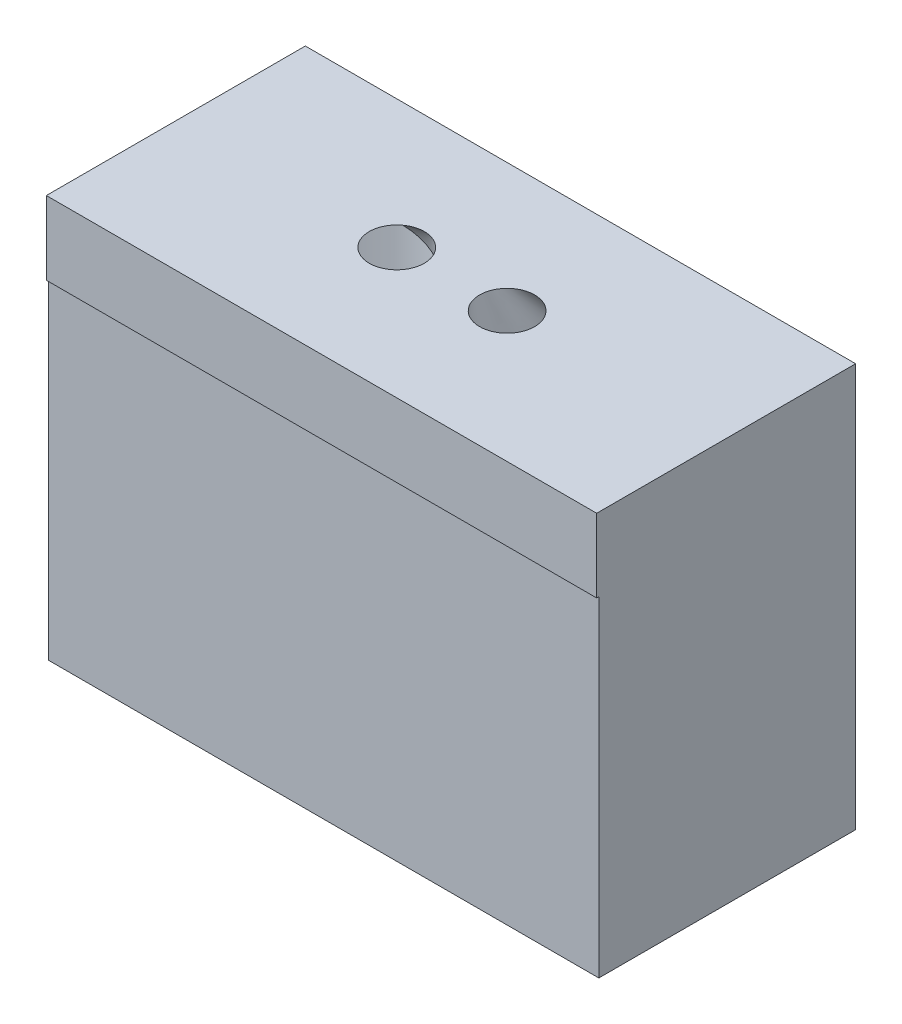
ISO-10303-21;
HEADER;
FILE_DESCRIPTION(('STEP AP214'),'2;1');
FILE_NAME('part.step','',(''),(''),'','','');
FILE_SCHEMA(('AUTOMOTIVE_DESIGN { 1 0 10303 214 1 1 1 1 }'));
ENDSEC;
DATA;
#1=APPLICATION_CONTEXT('core data for automotive mechanical design processes');
#2=APPLICATION_PROTOCOL_DEFINITION('international standard','automotive_design',2000,#1);
#3=PRODUCT_CONTEXT('',#1,'mechanical');
#4=PRODUCT('Part','Part','',(#3));
#5=PRODUCT_RELATED_PRODUCT_CATEGORY('part','',(#4));
#6=PRODUCT_DEFINITION_FORMATION('','',#4);
#7=PRODUCT_DEFINITION_CONTEXT('part definition',#1,'design');
#8=PRODUCT_DEFINITION('design','',#6,#7);
#9=PRODUCT_DEFINITION_SHAPE('','',#8);
#10=(LENGTH_UNIT() NAMED_UNIT(*) SI_UNIT(.MILLI.,.METRE.));
#11=(NAMED_UNIT(*) PLANE_ANGLE_UNIT() SI_UNIT($,.RADIAN.));
#12=(NAMED_UNIT(*) SI_UNIT($,.STERADIAN.) SOLID_ANGLE_UNIT());
#13=UNCERTAINTY_MEASURE_WITH_UNIT(LENGTH_MEASURE(1.E-05),#10,'distance_accuracy_value','');
#14=(GEOMETRIC_REPRESENTATION_CONTEXT(3) GLOBAL_UNCERTAINTY_ASSIGNED_CONTEXT((#13)) GLOBAL_UNIT_ASSIGNED_CONTEXT((#10,
#11,#12)) REPRESENTATION_CONTEXT('',''));
#15=CARTESIAN_POINT('',(0.,0.,0.));
#16=DIRECTION('',(0.,0.,1.));
#17=DIRECTION('',(1.,0.,0.));
#18=AXIS2_PLACEMENT_3D('',#15,#16,#17);
#19=CARTESIAN_POINT('',(-8.,9.,0.));
#20=DIRECTION('',(0.,-1.,0.));
#21=DIRECTION('',(0.,0.,-1.));
#22=AXIS2_PLACEMENT_3D('',#19,#20,#21);
#23=CYLINDRICAL_SURFACE('',#22,2.6);
#24=CARTESIAN_POINT('',(-8.,9.,0.));
#25=DIRECTION('',(0.,1.,0.));
#26=DIRECTION('',(0.,0.,1.));
#27=AXIS2_PLACEMENT_3D('',#24,#25,#26);
#28=CIRCLE('',#27,2.6);
#29=CARTESIAN_POINT('',(-5.4014964042924,9.,-0.0881989971295183));
#30=VERTEX_POINT('',#29);
#31=EDGE_CURVE('E176',#30,#30,#28,.T.);
#32=ORIENTED_EDGE('',*,*,#31,.T.);
#33=EDGE_LOOP('',(#32));
#34=FACE_BOUND('',#33,.T.);
#35=CARTESIAN_POINT('',(-8.,0.999999999999999,0.));
#36=DIRECTION('',(0.,-1.,0.));
#37=DIRECTION('',(0.,0.,-1.));
#38=AXIS2_PLACEMENT_3D('',#35,#36,#37);
#39=CIRCLE('',#38,2.6);
#40=CARTESIAN_POINT('',(-8.,0.999999999999999,-2.6));
#41=VERTEX_POINT('',#40);
#42=EDGE_CURVE('E166',#41,#41,#39,.T.);
#43=ORIENTED_EDGE('',*,*,#42,.T.);
#44=EDGE_LOOP('',(#43));
#45=FACE_BOUND('',#44,.T.);
#46=ADVANCED_FACE('F93',(#34,#45),#23,.F.);
#47=CARTESIAN_POINT('',(0.,9.,0.));
#48=DIRECTION('',(0.,-1.,0.));
#49=DIRECTION('',(0.,0.,-1.));
#50=AXIS2_PLACEMENT_3D('',#47,#48,#49);
#51=CYLINDRICAL_SURFACE('',#50,2.6);
#52=CARTESIAN_POINT('',(0.,9.,0.));
#53=DIRECTION('',(0.,1.,0.));
#54=DIRECTION('',(0.,0.,1.));
#55=AXIS2_PLACEMENT_3D('',#52,#53,#54);
#56=CIRCLE('',#55,2.6);
#57=CARTESIAN_POINT('',(2.15772817787684,9.,1.45058922869168));
#58=VERTEX_POINT('',#57);
#59=EDGE_CURVE('E280',#58,#58,#56,.T.);
#60=ORIENTED_EDGE('',*,*,#59,.T.);
#61=EDGE_LOOP('',(#60));
#62=FACE_BOUND('',#61,.T.);
#63=CARTESIAN_POINT('',(0.,0.999999999999999,0.));
#64=DIRECTION('',(0.,-1.,0.));
#65=DIRECTION('',(0.,0.,-1.));
#66=AXIS2_PLACEMENT_3D('',#63,#64,#65);
#67=CIRCLE('',#66,2.6);
#68=CARTESIAN_POINT('',(0.,0.999999999999999,-2.6));
#69=VERTEX_POINT('',#68);
#70=EDGE_CURVE('E162',#69,#69,#67,.T.);
#71=ORIENTED_EDGE('',*,*,#70,.T.);
#72=EDGE_LOOP('',(#71));
#73=FACE_BOUND('',#72,.T.);
#74=ADVANCED_FACE('F192',(#62,#73),#51,.F.);
#75=CARTESIAN_POINT('',(0.,0.,0.));
#76=DIRECTION('',(0.,1.,0.));
#77=DIRECTION('',(0.,0.,1.));
#78=AXIS2_PLACEMENT_3D('',#75,#76,#77);
#79=PLANE('',#78);
#80=CARTESIAN_POINT('',(0.,0.,0.));
#81=DIRECTION('',(0.,-1.,0.));
#82=DIRECTION('',(0.,0.,-1.));
#83=AXIS2_PLACEMENT_3D('',#80,#81,#82);
#84=CIRCLE('',#83,3.);
#85=CARTESIAN_POINT('',(0.,0.,-3.));
#86=VERTEX_POINT('',#85);
#87=EDGE_CURVE('E231',#86,#86,#84,.T.);
#88=ORIENTED_EDGE('',*,*,#87,.F.);
#89=EDGE_LOOP('',(#88));
#90=FACE_BOUND('',#89,.T.);
#91=CARTESIAN_POINT('',(-8.,0.,0.));
#92=DIRECTION('',(0.,-1.,0.));
#93=DIRECTION('',(0.,0.,-1.));
#94=AXIS2_PLACEMENT_3D('',#91,#92,#93);
#95=CIRCLE('',#94,3.);
#96=CARTESIAN_POINT('',(-8.,0.,-3.));
#97=VERTEX_POINT('',#96);
#98=EDGE_CURVE('E222',#97,#97,#95,.T.);
#99=ORIENTED_EDGE('',*,*,#98,.F.);
#100=EDGE_LOOP('',(#99));
#101=FACE_BOUND('',#100,.T.);
#102=DIRECTION('',(1.,0.,0.));
#103=VECTOR('',#102,1.);
#104=CARTESIAN_POINT('',(-11.5,0.,-3.5));
#105=LINE('',#104,#103);
#106=CARTESIAN_POINT('',(-11.5,0.,-3.5));
#107=VERTEX_POINT('',#106);
#108=CARTESIAN_POINT('',(3.5,0.,-3.5));
#109=VERTEX_POINT('',#108);
#110=EDGE_CURVE('E171',#107,#109,#105,.T.);
#111=ORIENTED_EDGE('',*,*,#110,.T.);
#112=DIRECTION('',(0.,0.,-1.));
#113=VECTOR('',#112,1.);
#114=CARTESIAN_POINT('',(3.5,0.,3.5));
#115=LINE('',#114,#113);
#116=CARTESIAN_POINT('',(3.5,0.,3.5));
#117=VERTEX_POINT('',#116);
#118=EDGE_CURVE('E144',#117,#109,#115,.T.);
#119=ORIENTED_EDGE('',*,*,#118,.F.);
#120=DIRECTION('',(1.,0.,0.));
#121=VECTOR('',#120,1.);
#122=CARTESIAN_POINT('',(-11.5,0.,3.5));
#123=LINE('',#122,#121);
#124=CARTESIAN_POINT('',(-11.5,0.,3.5));
#125=VERTEX_POINT('',#124);
#126=EDGE_CURVE('E129',#125,#117,#123,.T.);
#127=ORIENTED_EDGE('',*,*,#126,.F.);
#128=DIRECTION('',(0.,0.,-1.));
#129=VECTOR('',#128,1.);
#130=CARTESIAN_POINT('',(-11.5,0.,3.5));
#131=LINE('',#130,#129);
#132=EDGE_CURVE('E142',#125,#107,#131,.T.);
#133=ORIENTED_EDGE('',*,*,#132,.T.);
#134=EDGE_LOOP('',(#111,#119,#127,#133));
#135=FACE_BOUND('',#134,.T.);
#136=ADVANCED_FACE('F141',(#90,#101,#135),#79,.F.);
#137=CARTESIAN_POINT('',(-11.5,9.,-3.5));
#138=DIRECTION('',(0.,0.,-1.));
#139=DIRECTION('',(-1.,0.,0.));
#140=AXIS2_PLACEMENT_3D('',#137,#138,#139);
#141=PLANE('',#140);
#142=ORIENTED_EDGE('',*,*,#110,.F.);
#143=DIRECTION('',(0.,-1.,0.));
#144=VECTOR('',#143,1.);
#145=CARTESIAN_POINT('',(-11.5,9.,-3.5));
#146=LINE('',#145,#144);
#147=CARTESIAN_POINT('',(-11.5,11.,-3.5));
#148=VERTEX_POINT('',#147);
#149=EDGE_CURVE('E12',#148,#107,#146,.T.);
#150=ORIENTED_EDGE('',*,*,#149,.F.);
#151=DIRECTION('',(-1.,0.,0.));
#152=VECTOR('',#151,1.);
#153=CARTESIAN_POINT('',(-11.5,11.,-3.5));
#154=LINE('',#153,#152);
#155=CARTESIAN_POINT('',(3.5,11.,-3.5));
#156=VERTEX_POINT('',#155);
#157=EDGE_CURVE('E245',#156,#148,#154,.T.);
#158=ORIENTED_EDGE('',*,*,#157,.F.);
#159=DIRECTION('',(0.,-1.,0.));
#160=VECTOR('',#159,1.);
#161=CARTESIAN_POINT('',(3.5,9.,-3.5));
#162=LINE('',#161,#160);
#163=EDGE_CURVE('E154',#156,#109,#162,.T.);
#164=ORIENTED_EDGE('',*,*,#163,.T.);
#165=EDGE_LOOP('',(#142,#150,#158,#164));
#166=FACE_BOUND('',#165,.T.);
#167=ADVANCED_FACE('F95',(#166),#141,.T.);
#168=CARTESIAN_POINT('',(-11.5,9.,3.5));
#169=DIRECTION('',(-1.,0.,0.));
#170=DIRECTION('',(0.,0.,1.));
#171=AXIS2_PLACEMENT_3D('',#168,#169,#170);
#172=PLANE('',#171);
#173=ORIENTED_EDGE('',*,*,#132,.F.);
#174=DIRECTION('',(0.,-1.,0.));
#175=VECTOR('',#174,1.);
#176=CARTESIAN_POINT('',(-11.5,9.,3.5));
#177=LINE('',#176,#175);
#178=CARTESIAN_POINT('',(-11.5,9.,3.5));
#179=VERTEX_POINT('',#178);
#180=EDGE_CURVE('E106',#179,#125,#177,.T.);
#181=ORIENTED_EDGE('',*,*,#180,.F.);
#182=DIRECTION('',(0.,0.,1.));
#183=VECTOR('',#182,1.);
#184=CARTESIAN_POINT('',(-11.5,9.,-3.5));
#185=LINE('',#184,#183);
#186=CARTESIAN_POINT('',(-11.5,9.,3.55873911571481));
#187=VERTEX_POINT('',#186);
#188=EDGE_CURVE('E254',#179,#187,#185,.T.);
#189=ORIENTED_EDGE('',*,*,#188,.T.);
#190=DIRECTION('',(0.,-1.,0.));
#191=VECTOR('',#190,1.);
#192=CARTESIAN_POINT('',(-11.5,11.,3.55873911571481));
#193=LINE('',#192,#191);
#194=CARTESIAN_POINT('',(-11.5,11.,3.55873911571481));
#195=VERTEX_POINT('',#194);
#196=EDGE_CURVE('E227',#195,#187,#193,.T.);
#197=ORIENTED_EDGE('',*,*,#196,.F.);
#198=DIRECTION('',(0.,0.,1.));
#199=VECTOR('',#198,1.);
#200=CARTESIAN_POINT('',(-11.5,11.,-3.5));
#201=LINE('',#200,#199);
#202=EDGE_CURVE('E249',#148,#195,#201,.T.);
#203=ORIENTED_EDGE('',*,*,#202,.F.);
#204=ORIENTED_EDGE('',*,*,#149,.T.);
#205=EDGE_LOOP('',(#173,#181,#189,#197,#203,#204));
#206=FACE_BOUND('',#205,.T.);
#207=ADVANCED_FACE('F147',(#206),#172,.T.);
#208=CARTESIAN_POINT('',(-11.5,9.,3.5));
#209=DIRECTION('',(0.,0.,-1.));
#210=DIRECTION('',(-1.,0.,0.));
#211=AXIS2_PLACEMENT_3D('',#208,#209,#210);
#212=PLANE('',#211);
#213=ORIENTED_EDGE('',*,*,#126,.T.);
#214=DIRECTION('',(0.,-1.,0.));
#215=VECTOR('',#214,1.);
#216=CARTESIAN_POINT('',(3.5,9.,3.5));
#217=LINE('',#216,#215);
#218=CARTESIAN_POINT('',(3.5,9.,3.5));
#219=VERTEX_POINT('',#218);
#220=EDGE_CURVE('E135',#219,#117,#217,.T.);
#221=ORIENTED_EDGE('',*,*,#220,.F.);
#222=DIRECTION('',(1.,0.,0.));
#223=VECTOR('',#222,1.);
#224=CARTESIAN_POINT('',(-11.5,9.,3.5));
#225=LINE('',#224,#223);
#226=EDGE_CURVE('E132',#179,#219,#225,.T.);
#227=ORIENTED_EDGE('',*,*,#226,.F.);
#228=ORIENTED_EDGE('',*,*,#180,.T.);
#229=EDGE_LOOP('',(#213,#221,#227,#228));
#230=FACE_BOUND('',#229,.T.);
#231=ADVANCED_FACE('F127',(#230),#212,.F.);
#232=CARTESIAN_POINT('',(3.5,9.,3.5));
#233=DIRECTION('',(-1.,0.,0.));
#234=DIRECTION('',(0.,0.,1.));
#235=AXIS2_PLACEMENT_3D('',#232,#233,#234);
#236=PLANE('',#235);
#237=ORIENTED_EDGE('',*,*,#118,.T.);
#238=ORIENTED_EDGE('',*,*,#163,.F.);
#239=DIRECTION('',(0.,0.,-1.));
#240=VECTOR('',#239,1.);
#241=CARTESIAN_POINT('',(3.5,11.,-3.5));
#242=LINE('',#241,#240);
#243=CARTESIAN_POINT('',(3.5,11.,3.5587391157148));
#244=VERTEX_POINT('',#243);
#245=EDGE_CURVE('E260',#244,#156,#242,.T.);
#246=ORIENTED_EDGE('',*,*,#245,.F.);
#247=DIRECTION('',(0.,-1.,0.));
#248=VECTOR('',#247,1.);
#249=CARTESIAN_POINT('',(3.5,11.,3.5587391157148));
#250=LINE('',#249,#248);
#251=CARTESIAN_POINT('',(3.5,9.,3.5587391157148));
#252=VERTEX_POINT('',#251);
#253=EDGE_CURVE('E241',#244,#252,#250,.T.);
#254=ORIENTED_EDGE('',*,*,#253,.T.);
#255=DIRECTION('',(0.,0.,-1.));
#256=VECTOR('',#255,1.);
#257=CARTESIAN_POINT('',(3.5,9.,-3.5));
#258=LINE('',#257,#256);
#259=EDGE_CURVE('E246',#252,#219,#258,.T.);
#260=ORIENTED_EDGE('',*,*,#259,.T.);
#261=ORIENTED_EDGE('',*,*,#220,.T.);
#262=EDGE_LOOP('',(#237,#238,#246,#254,#260,#261));
#263=FACE_BOUND('',#262,.T.);
#264=ADVANCED_FACE('F201',(#263),#236,.F.);
#265=CARTESIAN_POINT('',(0.,1.,0.));
#266=DIRECTION('',(0.,-1.,0.));
#267=DIRECTION('',(0.,0.,-1.));
#268=AXIS2_PLACEMENT_3D('',#265,#266,#267);
#269=CYLINDRICAL_SURFACE('',#268,3.);
#270=CARTESIAN_POINT('',(0.,1.,0.));
#271=DIRECTION('',(0.,-1.,0.));
#272=DIRECTION('',(0.,0.,-1.));
#273=AXIS2_PLACEMENT_3D('',#270,#271,#272);
#274=CIRCLE('',#273,3.);
#275=CARTESIAN_POINT('',(0.,1.,-3.));
#276=VERTEX_POINT('',#275);
#277=EDGE_CURVE('E167',#276,#276,#274,.T.);
#278=ORIENTED_EDGE('',*,*,#277,.F.);
#279=EDGE_LOOP('',(#278));
#280=FACE_BOUND('',#279,.T.);
#281=ORIENTED_EDGE('',*,*,#87,.T.);
#282=EDGE_LOOP('',(#281));
#283=FACE_BOUND('',#282,.T.);
#284=ADVANCED_FACE('F203',(#280,#283),#269,.F.);
#285=CARTESIAN_POINT('',(0.,1.,0.));
#286=DIRECTION('',(0.,-1.,0.));
#287=DIRECTION('',(0.,0.,-1.));
#288=AXIS2_PLACEMENT_3D('',#285,#286,#287);
#289=PLANE('',#288);
#290=ORIENTED_EDGE('',*,*,#70,.F.);
#291=EDGE_LOOP('',(#290));
#292=FACE_BOUND('',#291,.T.);
#293=ORIENTED_EDGE('',*,*,#277,.T.);
#294=EDGE_LOOP('',(#293));
#295=FACE_BOUND('',#294,.T.);
#296=ADVANCED_FACE('F209',(#292,#295),#289,.T.);
#297=CARTESIAN_POINT('',(-8.,1.,0.));
#298=DIRECTION('',(0.,-1.,0.));
#299=DIRECTION('',(0.,0.,-1.));
#300=AXIS2_PLACEMENT_3D('',#297,#298,#299);
#301=CYLINDRICAL_SURFACE('',#300,3.);
#302=CARTESIAN_POINT('',(-8.,1.,0.));
#303=DIRECTION('',(0.,-1.,0.));
#304=DIRECTION('',(0.,0.,-1.));
#305=AXIS2_PLACEMENT_3D('',#302,#303,#304);
#306=CIRCLE('',#305,3.);
#307=CARTESIAN_POINT('',(-8.,1.,-3.));
#308=VERTEX_POINT('',#307);
#309=EDGE_CURVE('E226',#308,#308,#306,.T.);
#310=ORIENTED_EDGE('',*,*,#309,.F.);
#311=EDGE_LOOP('',(#310));
#312=FACE_BOUND('',#311,.T.);
#313=ORIENTED_EDGE('',*,*,#98,.T.);
#314=EDGE_LOOP('',(#313));
#315=FACE_BOUND('',#314,.T.);
#316=ADVANCED_FACE('F378',(#312,#315),#301,.F.);
#317=CARTESIAN_POINT('',(-8.,1.,0.));
#318=DIRECTION('',(0.,-1.,0.));
#319=DIRECTION('',(0.,0.,-1.));
#320=AXIS2_PLACEMENT_3D('',#317,#318,#319);
#321=PLANE('',#320);
#322=ORIENTED_EDGE('',*,*,#42,.F.);
#323=EDGE_LOOP('',(#322));
#324=FACE_BOUND('',#323,.T.);
#325=ORIENTED_EDGE('',*,*,#309,.T.);
#326=EDGE_LOOP('',(#325));
#327=FACE_BOUND('',#326,.T.);
#328=ADVANCED_FACE('F387',(#324,#327),#321,.T.);
#329=CARTESIAN_POINT('',(0.,9.,0.));
#330=DIRECTION('',(0.,1.,0.));
#331=DIRECTION('',(0.,0.,1.));
#332=AXIS2_PLACEMENT_3D('',#329,#330,#331);
#333=PLANE('',#332);
#334=ORIENTED_EDGE('',*,*,#188,.F.);
#335=ORIENTED_EDGE('',*,*,#226,.T.);
#336=ORIENTED_EDGE('',*,*,#259,.F.);
#337=DIRECTION('',(1.,0.,0.));
#338=VECTOR('',#337,1.);
#339=CARTESIAN_POINT('',(-11.5,9.,3.55873911571481));
#340=LINE('',#339,#338);
#341=EDGE_CURVE('E250',#187,#252,#340,.T.);
#342=ORIENTED_EDGE('',*,*,#341,.F.);
#343=EDGE_LOOP('',(#334,#335,#336,#342));
#344=FACE_BOUND('',#343,.T.);
#345=ADVANCED_FACE('F392',(#344),#333,.F.);
#346=CARTESIAN_POINT('',(0.,11.,0.));
#347=DIRECTION('',(0.,1.,0.));
#348=DIRECTION('',(0.,0.,1.));
#349=AXIS2_PLACEMENT_3D('',#346,#347,#348);
#350=PLANE('',#349);
#351=CARTESIAN_POINT('',(-2.5,11.,0.));
#352=DIRECTION('',(0.,1.,0.));
#353=DIRECTION('',(0.,0.,1.));
#354=AXIS2_PLACEMENT_3D('',#351,#352,#353);
#355=CIRCLE('',#354,0.75);
#356=CARTESIAN_POINT('',(-1.88021981003524,11.,0.42234170540837));
#357=VERTEX_POINT('',#356);
#358=EDGE_CURVE('E326',#357,#357,#355,.T.);
#359=ORIENTED_EDGE('',*,*,#358,.F.);
#360=EDGE_LOOP('',(#359));
#361=FACE_BOUND('',#360,.T.);
#362=CARTESIAN_POINT('',(-5.5,11.,0.00748241817097219));
#363=DIRECTION('',(0.,1.,0.));
#364=DIRECTION('',(0.,0.,1.));
#365=AXIS2_PLACEMENT_3D('',#362,#363,#364);
#366=CIRCLE('',#365,0.75);
#367=CARTESIAN_POINT('',(-4.75026113457743,11.,-0.012307318433604));
#368=VERTEX_POINT('',#367);
#369=EDGE_CURVE('E274',#368,#368,#366,.T.);
#370=ORIENTED_EDGE('',*,*,#369,.F.);
#371=EDGE_LOOP('',(#370));
#372=FACE_BOUND('',#371,.T.);
#373=ORIENTED_EDGE('',*,*,#202,.T.);
#374=DIRECTION('',(1.,0.,0.));
#375=VECTOR('',#374,1.);
#376=CARTESIAN_POINT('',(-11.5,11.,3.55873911571481));
#377=LINE('',#376,#375);
#378=EDGE_CURVE('E263',#195,#244,#377,.T.);
#379=ORIENTED_EDGE('',*,*,#378,.T.);
#380=ORIENTED_EDGE('',*,*,#245,.T.);
#381=ORIENTED_EDGE('',*,*,#157,.T.);
#382=EDGE_LOOP('',(#373,#379,#380,#381));
#383=FACE_BOUND('',#382,.T.);
#384=ADVANCED_FACE('F303',(#361,#372,#383),#350,.T.);
#385=CARTESIAN_POINT('',(-11.5,11.,3.55873911571481));
#386=DIRECTION('',(0.,0.,-1.));
#387=DIRECTION('',(-1.,0.,0.));
#388=AXIS2_PLACEMENT_3D('',#385,#386,#387);
#389=PLANE('',#388);
#390=ORIENTED_EDGE('',*,*,#341,.T.);
#391=ORIENTED_EDGE('',*,*,#253,.F.);
#392=ORIENTED_EDGE('',*,*,#378,.F.);
#393=ORIENTED_EDGE('',*,*,#196,.T.);
#394=EDGE_LOOP('',(#390,#391,#392,#393));
#395=FACE_BOUND('',#394,.T.);
#396=ADVANCED_FACE('F298',(#395),#389,.F.);
#397=CARTESIAN_POINT('',(-4.75026113457743,11.,-0.012307318433604));
#398=CARTESIAN_POINT('',(-5.4014964042924,9.,-0.0881989971295183));
#399=CARTESIAN_POINT('',(-4.74861198986038,11.,0.0501709203516101));
#400=CARTESIAN_POINT('',(-5.39414648786494,9.,0.128342969179449));
#401=CARTESIAN_POINT('',(-4.75434383119274,11.,0.121046840063037));
#402=CARTESIAN_POINT('',(-5.41216376550537,9.00000000000001,0.374188991305731));
#403=CARTESIAN_POINT('',(-4.79507529469736,11.,0.27577546663476));
#404=CARTESIAN_POINT('',(-5.54931789234351,9.,0.911630947801852));
#405=CARTESIAN_POINT('',(-4.83046686170321,11.,0.359938623567413));
#406=CARTESIAN_POINT('',(-5.66980533052675,9.,1.20431332307511));
#407=CARTESIAN_POINT('',(-4.94620326969518,11.,0.523049272714293));
#408=CARTESIAN_POINT('',(-6.06675011978566,9.,1.77277259636679));
#409=CARTESIAN_POINT('',(-5.02741092698624,11.,0.60162078464618));
#410=CARTESIAN_POINT('',(-6.34620830966389,9.,2.04726868524411));
#411=CARTESIAN_POINT('',(-5.18087480364371,11.,0.688745448624715));
#412=CARTESIAN_POINT('',(-6.8759240461148,9.,2.35330347725246));
#413=CARTESIAN_POINT('',(-5.23725820557715,11.,0.712300223673275));
#414=CARTESIAN_POINT('',(-7.07001431325034,9.,2.43734235050226));
#415=CARTESIAN_POINT('',(-5.3556868160604,11.,0.745713568799165));
#416=CARTESIAN_POINT('',(-7.47975201442716,9.,2.55633588259026));
#417=CARTESIAN_POINT('',(-5.41773202461021,11.,0.755572138876494));
#418=CARTESIAN_POINT('',(-7.69525903656152,9.,2.59115367928014));
#419=CARTESIAN_POINT('',(-5.54268850218063,11.,0.75887042831059));
#420=CARTESIAN_POINT('',(-8.12834296917945,9.,2.60585351213506));
#421=CARTESIAN_POINT('',(-5.60516739584634,11.,0.75229873490115));
#422=CARTESIAN_POINT('',(-8.34571486951741,9.,2.58572858979934));
#423=CARTESIAN_POINT('',(-5.7251937935987,11.,0.725179530338943));
#424=CARTESIAN_POINT('',(-8.76257807547219,9.,2.49479173277455));
#425=CARTESIAN_POINT('',(-5.78274129768536,11.,0.704632019186175));
#426=CARTESIAN_POINT('',(-8.96192001221918,9.,2.4241068244291));
#427=CARTESIAN_POINT('',(-5.94058767656667,11.,0.625724546877359));
#428=CARTESIAN_POINT('',(-9.51116770651191,9.,2.15469445337418));
#429=CARTESIAN_POINT('',(-6.02582723590368,11.,0.551546493424883));
#430=CARTESIAN_POINT('',(-9.80859529760462,9.,1.89977915223329));
#431=CARTESIAN_POINT('',(-6.15000726484693,11.,0.394768559991467));
#432=CARTESIAN_POINT('',(-10.2431716589721,9.,1.35954355802306));
#433=CARTESIAN_POINT('',(-6.18978951474746,11.,0.312589653982366));
#434=CARTESIAN_POINT('',(-10.3832275146518,9.00000000000001,1.07570460219532));
#435=CARTESIAN_POINT('',(-6.23862685436531,11.,0.160225241277004));
#436=CARTESIAN_POINT('',(-10.5565079507142,9.00000000000001,0.54879948588961));
#437=CARTESIAN_POINT('',(-6.24808972070552,11.,0.0897503935607624));
#438=CARTESIAN_POINT('',(-10.5911536792801,9.,0.304740963438486));
#439=CARTESIAN_POINT('',(-6.25138801013962,11.,-0.0352060840096658));
#440=CARTESIAN_POINT('',(-10.6058535121351,9.,-0.128342969179448));
#441=CARTESIAN_POINT('',(-6.24565616880726,11.,-0.106082003721093));
#442=CARTESIAN_POINT('',(-10.5878362344946,9.00000000000001,-0.374188991305731));
#443=CARTESIAN_POINT('',(-6.20492470530264,11.,-0.260810630292815));
#444=CARTESIAN_POINT('',(-10.4506821076565,9.,-0.911630947801851));
#445=CARTESIAN_POINT('',(-6.16953313829679,11.,-0.344973787225469));
#446=CARTESIAN_POINT('',(-10.3301946694733,9.,-1.20431332307511));
#447=CARTESIAN_POINT('',(-6.05379673030482,11.,-0.508084436372349));
#448=CARTESIAN_POINT('',(-9.93324988021434,9.,-1.77277259636679));
#449=CARTESIAN_POINT('',(-5.97258907301375,11.,-0.586655948304235));
#450=CARTESIAN_POINT('',(-9.6537916903361,9.,-2.04726868524411));
#451=CARTESIAN_POINT('',(-5.81912519635628,11.,-0.673780612282771));
#452=CARTESIAN_POINT('',(-9.1240759538852,9.,-2.35330347725246));
#453=CARTESIAN_POINT('',(-5.76274179442284,11.,-0.697335387331331));
#454=CARTESIAN_POINT('',(-8.92998568674966,9.,-2.43734235050226));
#455=CARTESIAN_POINT('',(-5.64431318393959,11.,-0.730748732457221));
#456=CARTESIAN_POINT('',(-8.52024798557284,9.,-2.55633588259025));
#457=CARTESIAN_POINT('',(-5.58226797538979,11.,-0.74060730253455));
#458=CARTESIAN_POINT('',(-8.30474096343849,9.,-2.59115367928014));
#459=CARTESIAN_POINT('',(-5.45731149781936,11.,-0.743905591968646));
#460=CARTESIAN_POINT('',(-7.87165703082055,9.,-2.60585351213506));
#461=CARTESIAN_POINT('',(-5.39483260415365,11.,-0.737333898559205));
#462=CARTESIAN_POINT('',(-7.65428513048259,9.,-2.58572858979934));
#463=CARTESIAN_POINT('',(-5.27480620640129,11.,-0.710214693996997));
#464=CARTESIAN_POINT('',(-7.23742192452781,9.,-2.49479173277455));
#465=CARTESIAN_POINT('',(-5.21725870231464,11.,-0.68966718284423));
#466=CARTESIAN_POINT('',(-7.03807998778083,9.,-2.4241068244291));
#467=CARTESIAN_POINT('',(-5.05941232343332,11.,-0.610759710535415));
#468=CARTESIAN_POINT('',(-6.48883229348809,9.,-2.15469445337418));
#469=CARTESIAN_POINT('',(-4.97417276409632,11.,-0.536581657082939));
#470=CARTESIAN_POINT('',(-6.19140470239539,9.00000000000001,-1.89977915223329));
#471=CARTESIAN_POINT('',(-4.84999273515306,11.,-0.379803723649522));
#472=CARTESIAN_POINT('',(-5.75682834102787,9.,-1.35954355802306));
#473=CARTESIAN_POINT('',(-4.81021048525254,11.,-0.297624817640421));
#474=CARTESIAN_POINT('',(-5.61677248534816,9.,-1.07570460219532));
#475=CARTESIAN_POINT('',(-4.76137314563468,11.,-0.145260404935059));
#476=CARTESIAN_POINT('',(-5.44349204928577,9.,-0.548799485889608));
#477=CARTESIAN_POINT('',(-4.75191027929448,11.,-0.0747855572188183));
#478=CARTESIAN_POINT('',(-5.40884632071986,9.,-0.304740963438486));
#479=CARTESIAN_POINT('',(-4.75026113457743,11.,-0.012307318433604));
#480=CARTESIAN_POINT('',(-5.4014964042924,9.,-0.0881989971295183));
#481=B_SPLINE_SURFACE_WITH_KNOTS('',3,1,((#397,#398),(#399,#400),(#401,#402),(#403,#404),(#405,
#406),(#407,#408),(#409,#410),(#411,#412),(#413,#414),(#415,#416),(#417,#418),(#419,#420),(#421,
#422),(#423,#424),(#425,#426),(#427,#428),(#429,#430),(#431,#432),(#433,#434),(#435,#436),(#437,
#438),(#439,#440),(#441,#442),(#443,#444),(#445,#446),(#447,#448),(#449,#450),(#451,#452),(#453,
#454),(#455,#456),(#457,#458),(#459,#460),(#461,#462),(#463,#464),(#465,#466),(#467,#468),(#469,
#470),(#471,#472),(#473,#474),(#475,#476),(#477,#478),(#479,#480)),.UNSPECIFIED.,.T.,.F.,.F.,(4,
2,2,2,2,2,2,2,2,2,2,2,2,2,2,2,2,2,2,2,4),(2,2),(0.,0.0625,0.125,0.1875,0.218749999999999,0.25,
0.281249999999999,0.3125,0.375,0.4375,0.5,0.5625,0.625,0.6875,0.71875,0.75,0.78125,0.8125,0.875,
0.9375,1.),(0.,1.),.UNSPECIFIED.);
#482=CARTESIAN_POINT('',(-4.75026113457743,11.,-0.012307318433604));
#483=CARTESIAN_POINT('',(-4.75704483530363,10.9791666666667,-0.0130978567533531));
#484=CARTESIAN_POINT('',(-4.76382853602982,10.9583333333333,-0.0138883950731022));
#485=CARTESIAN_POINT('',(-4.77739593748222,10.9166666666667,-0.0154694717126004));
#486=CARTESIAN_POINT('',(-4.78417963820842,10.8958333333333,-0.0162600100323495));
#487=CARTESIAN_POINT('',(-4.79774703966081,10.8541666666667,-0.0178410866718477));
#488=CARTESIAN_POINT('',(-4.80453074038701,10.8333333333333,-0.0186316249915969));
#489=CARTESIAN_POINT('',(-4.8180981418394,10.7916666666667,-0.0202127016310951));
#490=CARTESIAN_POINT('',(-4.8248818425656,10.7708333333333,-0.0210032399508442));
#491=CARTESIAN_POINT('',(-4.838449244018,10.7291666666667,-0.0225843165903424));
#492=CARTESIAN_POINT('',(-4.8452329447442,10.7083333333333,-0.0233748549100915));
#493=CARTESIAN_POINT('',(-4.85880034619659,10.6666666666667,-0.0249559315495897));
#494=CARTESIAN_POINT('',(-4.86558404692279,10.6458333333333,-0.0257464698693388));
#495=CARTESIAN_POINT('',(-4.87915144837518,10.6041666666667,-0.027327546508837));
#496=CARTESIAN_POINT('',(-4.88593514910138,10.5833333333333,-0.0281180848285862));
#497=CARTESIAN_POINT('',(-4.89950255055378,10.5416666666667,-0.0296991614680844));
#498=CARTESIAN_POINT('',(-4.90628625127997,10.5208333333333,-0.0304896997878335));
#499=CARTESIAN_POINT('',(-4.91985365273237,10.4791666666667,-0.0320707764273317));
#500=CARTESIAN_POINT('',(-4.92663735345857,10.4583333333333,-0.0328613147470808));
#501=CARTESIAN_POINT('',(-4.94020475491096,10.4166666666667,-0.034442391386579));
#502=CARTESIAN_POINT('',(-4.94698845563716,10.3958333333333,-0.0352329297063281));
#503=CARTESIAN_POINT('',(-4.96055585708955,10.3541666666667,-0.0368140063458263));
#504=CARTESIAN_POINT('',(-4.96733955781575,10.3333333333333,-0.0376045446655754));
#505=CARTESIAN_POINT('',(-4.98090695926815,10.2916666666667,-0.0391856213050736));
#506=CARTESIAN_POINT('',(-4.98769065999435,10.2708333333333,-0.0399761596248228));
#507=CARTESIAN_POINT('',(-5.00125806144674,10.2291666666667,-0.041557236264321));
#508=CARTESIAN_POINT('',(-5.00804176217294,10.2083333333333,-0.0423477745840701));
#509=CARTESIAN_POINT('',(-5.02160916362533,10.1666666666667,-0.0439288512235683));
#510=CARTESIAN_POINT('',(-5.02839286435153,10.1458333333333,-0.0447193895433174));
#511=CARTESIAN_POINT('',(-5.04196026580393,10.1041666666667,-0.0463004661828156));
#512=CARTESIAN_POINT('',(-5.04874396653012,10.0833333333333,-0.0470910045025647));
#513=CARTESIAN_POINT('',(-5.06231136798252,10.0416666666667,-0.0486720811420629));
#514=CARTESIAN_POINT('',(-5.06909506870872,10.0208333333333,-0.049462619461812));
#515=CARTESIAN_POINT('',(-5.08266247016111,9.97916666666667,-0.0510436961013102));
#516=CARTESIAN_POINT('',(-5.08944617088731,9.95833333333333,-0.0518342344210593));
#517=CARTESIAN_POINT('',(-5.1030135723397,9.91666666666667,-0.0534153110605576));
#518=CARTESIAN_POINT('',(-5.1097972730659,9.89583333333333,-0.0542058493803067));
#519=CARTESIAN_POINT('',(-5.1233646745183,9.85416666666667,-0.0557869260198049));
#520=CARTESIAN_POINT('',(-5.13014837524449,9.83333333333333,-0.056577464339554));
#521=CARTESIAN_POINT('',(-5.14371577669689,9.79166666666667,-0.0581585409790522));
#522=CARTESIAN_POINT('',(-5.15049947742309,9.77083333333333,-0.0589490792988013));
#523=CARTESIAN_POINT('',(-5.16406687887548,9.72916666666667,-0.0605301559382996));
#524=CARTESIAN_POINT('',(-5.17085057960168,9.70833333333333,-0.0613206942580486));
#525=CARTESIAN_POINT('',(-5.18441798105408,9.66666666666667,-0.0629017708975468));
#526=CARTESIAN_POINT('',(-5.19120168178027,9.64583333333333,-0.0636923092172959));
#527=CARTESIAN_POINT('',(-5.20476908323267,9.60416666666667,-0.0652733858567942));
#528=CARTESIAN_POINT('',(-5.21155278395887,9.58333333333333,-0.0660639241765433));
#529=CARTESIAN_POINT('',(-5.22512018541126,9.54166666666667,-0.0676450008160415));
#530=CARTESIAN_POINT('',(-5.23190388613746,9.52083333333333,-0.0684355391357906));
#531=CARTESIAN_POINT('',(-5.24547128758985,9.47916666666667,-0.0700166157752888));
#532=CARTESIAN_POINT('',(-5.25225498831605,9.45833333333333,-0.0708071540950379));
#533=CARTESIAN_POINT('',(-5.26582238976845,9.41666666666667,-0.0723882307345361));
#534=CARTESIAN_POINT('',(-5.27260609049464,9.39583333333333,-0.0731787690542852));
#535=CARTESIAN_POINT('',(-5.28617349194704,9.35416666666667,-0.0747598456937834));
#536=CARTESIAN_POINT('',(-5.29295719267324,9.33333333333333,-0.0755503840135325));
#537=CARTESIAN_POINT('',(-5.30652459412563,9.29166666666667,-0.0771314606530308));
#538=CARTESIAN_POINT('',(-5.31330829485183,9.27083333333333,-0.0779219989727799));
#539=CARTESIAN_POINT('',(-5.32687569630422,9.22916666666667,-0.0795030756122781));
#540=CARTESIAN_POINT('',(-5.33365939703042,9.20833333333333,-0.0802936139320272));
#541=CARTESIAN_POINT('',(-5.34722679848282,9.16666666666667,-0.0818746905715254));
#542=CARTESIAN_POINT('',(-5.35401049920902,9.14583333333333,-0.0826652288912745));
#543=CARTESIAN_POINT('',(-5.36757790066141,9.10416666666667,-0.0842463055307727));
#544=CARTESIAN_POINT('',(-5.37436160138761,9.08333333333333,-0.0850368438505218));
#545=CARTESIAN_POINT('',(-5.38792900284,9.04166666666667,-0.08661792049002));
#546=CARTESIAN_POINT('',(-5.3947127035662,9.02083333333333,-0.0874084588097691));
#547=CARTESIAN_POINT('',(-5.4014964042924,9.,-0.0881989971295183));
#548=B_SPLINE_CURVE_WITH_KNOTS('',3,(#482,#483,#484,#485,#486,#487,#488,#489,#490,#491,#492,
#493,#494,#495,#496,#497,#498,#499,#500,#501,#502,#503,#504,#505,#506,#507,#508,#509,#510,#511,
#512,#513,#514,#515,#516,#517,#518,#519,#520,#521,#522,#523,#524,#525,#526,#527,#528,#529,#530,
#531,#532,#533,#534,#535,#536,#537,#538,#539,#540,#541,#542,#543,#544,#545,#546,#547),
.UNSPECIFIED.,.F.,.F.,(4,2,2,2,2,2,2,2,2,2,2,2,2,2,2,2,2,2,2,2,2,2,2,2,2,2,2,2,2,2,2,2,4),(0.,
0.0657726532640922,0.131545306528184,0.197317959792274,0.263090613056366,0.32886326632046,
0.394635919584552,0.460408572848642,0.526181226112734,0.591953879376826,0.657726532640917,
0.723499185905009,0.789271839169101,0.855044492433193,0.920817145697285,0.986589798961377,
1.05236245222547,1.11813510548956,1.18390775875365,1.24968041201774,1.31545306528183,
1.38122571854593,1.44699837181002,1.51277102507411,1.5785436783382,1.64431633160229,
1.71008898486639,1.77586163813048,1.84163429139457,1.90740694465866,1.97317959792275,
2.03895225118684,2.10472490445094),.UNSPECIFIED.);
#549=EDGE_CURVE('',#368,#30,#548,.T.);
#550=ORIENTED_EDGE('',*,*,#369,.T.);
#551=ORIENTED_EDGE('',*,*,#31,.F.);
#552=ORIENTED_EDGE('',*,*,#549,.T.);
#553=ORIENTED_EDGE('',*,*,#549,.F.);
#554=EDGE_LOOP('',(#550,#552,#551,#553));
#555=FACE_BOUND('',#554,.T.);
#556=ADVANCED_FACE('F286',(#555),#481,.F.);
#557=CARTESIAN_POINT('',(-1.88021981003524,11.,0.42234170540837));
#558=CARTESIAN_POINT('',(2.15772817787684,9.,1.45058922869168));
#559=CARTESIAN_POINT('',(-1.91541495215261,11.,0.473990054572099));
#560=CARTESIAN_POINT('',(2.03684574215253,9.,1.63039991018141));
#561=CARTESIAN_POINT('',(-1.96150813617408,11.,0.528134937864639));
#562=CARTESIAN_POINT('',(1.87823855199204,9.,1.81910244889853));
#563=CARTESIAN_POINT('',(-2.08502525412227,11.,0.629838042899695));
#564=CARTESIAN_POINT('',(1.45226958146414,9.,2.17435664980052));
#565=CARTESIAN_POINT('',(-2.16294867416581,11.,0.677418927808646));
#566=CARTESIAN_POINT('',(1.18317677704372,9.,2.34099775566791));
#567=CARTESIAN_POINT('',(-2.35221306838062,11.,0.742064028802454));
#568=CARTESIAN_POINT('',(0.528481233129204,9.,2.56921882369097));
#569=CARTESIAN_POINT('',(-2.4640341351671,11.,0.758318723899555));
#570=CARTESIAN_POINT('',(0.14119657278674,9.,2.62800295898601));
#571=CARTESIAN_POINT('',(-2.63947270254064,11.,0.739261505056544));
#572=CARTESIAN_POINT('',(-0.467393551748705,9.,2.56576056442046));
#573=CARTESIAN_POINT('',(-2.69898565929017,11.,0.725400645772028));
#574=CARTESIAN_POINT('',(-0.673927882734249,8.99999999999999,2.52018497733489));
#575=CARTESIAN_POINT('',(-2.81459598614217,11.,0.683257559284817));
#576=CARTESIAN_POINT('',(-1.07571736531333,9.,2.37662434159765));
#577=CARTESIAN_POINT('',(-2.87069335624464,11.,0.654975332082121));
#578=CARTESIAN_POINT('',(-1.27077854720194,9.,2.27861061360114));
#579=CARTESIAN_POINT('',(-2.9739900545721,11.,0.584585047847393));
#580=CARTESIAN_POINT('',(-1.63039991018141,9.,2.03684574215253));
#581=CARTESIAN_POINT('',(-3.0208319547752,11.,0.542720555812712));
#582=CARTESIAN_POINT('',(-1.79478985630755,9.,1.89320904360999));
#583=CARTESIAN_POINT('',(-3.10234318199791,11.,0.450537546260295));
#584=CARTESIAN_POINT('',(-2.07938775149568,9.,1.57532780399536));
#585=CARTESIAN_POINT('',(-3.13701250901754,11.,0.400219028742558));
#586=CARTESIAN_POINT('',(-2.19954904402353,9.,1.40127370955379));
#587=CARTESIAN_POINT('',(-3.21892211740791,11.,0.243909449492128));
#588=CARTESIAN_POINT('',(-2.48690141549231,9.00000000000001,0.861195317119326));
#589=CARTESIAN_POINT('',(-3.24469654192987,11.,0.133891973014402));
#590=CARTESIAN_POINT('',(-2.57864734301344,9.,0.480370334374956));
#591=CARTESIAN_POINT('',(-3.25376180850378,11.,-0.0659024737100854));
#592=CARTESIAN_POINT('',(-2.61442481601951,9.,-0.212039286829438));
#593=CARTESIAN_POINT('',(-3.23798168217405,11.,-0.155830153614649));
#594=CARTESIAN_POINT('',(-2.56168022356754,9.,-0.524126139360317));
#595=CARTESIAN_POINT('',(-3.18850763758697,11.,-0.307989014389158));
#596=CARTESIAN_POINT('',(-2.39348784602333,9.00000000000001,-1.05267740011667));
#597=CARTESIAN_POINT('',(-3.15497533208212,11.,-0.37069335624464));
#598=CARTESIAN_POINT('',(-2.27861061360114,9.,-1.27077854720194));
#599=CARTESIAN_POINT('',(-3.08458504784739,11.,-0.473990054572099));
#600=CARTESIAN_POINT('',(-2.03684574215253,9.,-1.63039991018141));
#601=CARTESIAN_POINT('',(-3.03849186382592,11.,-0.52813493786464));
#602=CARTESIAN_POINT('',(-1.87823855199204,9.,-1.81910244889853));
#603=CARTESIAN_POINT('',(-2.91497474587773,11.,-0.629838042899695));
#604=CARTESIAN_POINT('',(-1.45226958146414,9.00000000000001,-2.17435664980052));
#605=CARTESIAN_POINT('',(-2.83705132583419,11.,-0.677418927808646));
#606=CARTESIAN_POINT('',(-1.18317677704372,9.,-2.34099775566791));
#607=CARTESIAN_POINT('',(-2.64778693161938,11.,-0.742064028802455));
#608=CARTESIAN_POINT('',(-0.528481233129203,9.,-2.56921882369097));
#609=CARTESIAN_POINT('',(-2.5359658648329,11.,-0.758318723899555));
#610=CARTESIAN_POINT('',(-0.141196572786742,9.,-2.62800295898601));
#611=CARTESIAN_POINT('',(-2.36052729745936,11.,-0.739261505056544));
#612=CARTESIAN_POINT('',(0.467393551748705,9.00000000000001,-2.56576056442046));
#613=CARTESIAN_POINT('',(-2.30101434070983,11.,-0.725400645772029));
#614=CARTESIAN_POINT('',(0.673927882734249,9.,-2.52018497733489));
#615=CARTESIAN_POINT('',(-2.18540401385783,11.,-0.683257559284817));
#616=CARTESIAN_POINT('',(1.07571736531333,9.,-2.37662434159765));
#617=CARTESIAN_POINT('',(-2.12930664375536,11.,-0.654975332082121));
#618=CARTESIAN_POINT('',(1.27077854720194,9.00000000000001,-2.27861061360114));
#619=CARTESIAN_POINT('',(-2.0260099454279,11.,-0.584585047847393));
#620=CARTESIAN_POINT('',(1.63039991018141,9.00000000000001,-2.03684574215253));
#621=CARTESIAN_POINT('',(-1.97916804522481,11.,-0.542720555812712));
#622=CARTESIAN_POINT('',(1.79478985630755,9.,-1.89320904360999));
#623=CARTESIAN_POINT('',(-1.89765681800209,11.,-0.450537546260295));
#624=CARTESIAN_POINT('',(2.07938775149568,9.,-1.57532780399536));
#625=CARTESIAN_POINT('',(-1.86298749098246,11.,-0.400219028742559));
#626=CARTESIAN_POINT('',(2.19954904402354,9.,-1.40127370955378));
#627=CARTESIAN_POINT('',(-1.78107788259209,11.,-0.243909449492128));
#628=CARTESIAN_POINT('',(2.48690141549231,9.00000000000001,-0.861195317119327));
#629=CARTESIAN_POINT('',(-1.75530345807013,11.,-0.133891973014402));
#630=CARTESIAN_POINT('',(2.57864734301344,9.,-0.480370334374954));
#631=CARTESIAN_POINT('',(-1.74623819149622,11.,0.0659024737100853));
#632=CARTESIAN_POINT('',(2.61442481601951,9.,0.212039286829437));
#633=CARTESIAN_POINT('',(-1.76201831782595,11.,0.155830153614649));
#634=CARTESIAN_POINT('',(2.56168022356754,9.00000000000001,0.524126139360319));
#635=CARTESIAN_POINT('',(-1.81149236241303,11.,0.307989014389158));
#636=CARTESIAN_POINT('',(2.39348784602333,9.00000000000001,1.05267740011668));
#637=CARTESIAN_POINT('',(-1.84502466791788,11.,0.37069335624464));
#638=CARTESIAN_POINT('',(2.27861061360114,9.,1.27077854720194));
#639=CARTESIAN_POINT('',(-1.88021981003524,11.,0.42234170540837));
#640=CARTESIAN_POINT('',(2.15772817787684,9.,1.45058922869168));
#641=B_SPLINE_SURFACE_WITH_KNOTS('',3,1,((#557,#558),(#559,#560),(#561,#562),(#563,#564),(#565,
#566),(#567,#568),(#569,#570),(#571,#572),(#573,#574),(#575,#576),(#577,#578),(#579,#580),(#581,
#582),(#583,#584),(#585,#586),(#587,#588),(#589,#590),(#591,#592),(#593,#594),(#595,#596),(#597,
#598),(#599,#600),(#601,#602),(#603,#604),(#605,#606),(#607,#608),(#609,#610),(#611,#612),(#613,
#614),(#615,#616),(#617,#618),(#619,#620),(#621,#622),(#623,#624),(#625,#626),(#627,#628),(#629,
#630),(#631,#632),(#633,#634),(#635,#636),(#637,#638),(#639,#640)),.UNSPECIFIED.,.T.,.F.,.F.,(4,
2,2,2,2,2,2,2,2,2,2,2,2,2,2,2,2,2,2,2,4),(2,2),(0.,0.0625,0.125,0.1875,0.21875,0.25,0.28125,
0.3125,0.375,0.4375,0.5,0.5625,0.625,0.6875,0.71875,0.75,0.78125,0.8125,0.875,0.9375,1.),(0.,
1.),.UNSPECIFIED.);
#642=CARTESIAN_POINT('',(-1.88021981003524,11.,0.42234170540837));
#643=CARTESIAN_POINT('',(-1.83815785182783,10.9791666666667,0.433052617109238));
#644=CARTESIAN_POINT('',(-1.79609589362041,10.9583333333333,0.443763528810105));
#645=CARTESIAN_POINT('',(-1.71197197720557,10.9166666666667,0.465185352211841));
#646=CARTESIAN_POINT('',(-1.66991001899816,10.8958333333333,0.475896263912709));
#647=CARTESIAN_POINT('',(-1.58578610258332,10.8541666666667,0.497318087314444));
#648=CARTESIAN_POINT('',(-1.5437241443759,10.8333333333333,0.508028999015312));
#649=CARTESIAN_POINT('',(-1.45960022796107,10.7916666666667,0.529450822417048));
#650=CARTESIAN_POINT('',(-1.41753826975365,10.7708333333333,0.540161734117915));
#651=CARTESIAN_POINT('',(-1.33341435333882,10.7291666666667,0.561583557519651));
#652=CARTESIAN_POINT('',(-1.2913523951314,10.7083333333333,0.572294469220519));
#653=CARTESIAN_POINT('',(-1.20722847871656,10.6666666666667,0.593716292622254));
#654=CARTESIAN_POINT('',(-1.16516652050915,10.6458333333333,0.604427204323122));
#655=CARTESIAN_POINT('',(-1.08104260409431,10.6041666666667,0.625849027724858));
#656=CARTESIAN_POINT('',(-1.03898064588689,10.5833333333333,0.636559939425725));
#657=CARTESIAN_POINT('',(-0.954856729472059,10.5416666666667,0.657981762827461));
#658=CARTESIAN_POINT('',(-0.912794771264642,10.5208333333333,0.668692674528329));
#659=CARTESIAN_POINT('',(-0.828670854849807,10.4791666666667,0.690114497930064));
#660=CARTESIAN_POINT('',(-0.786608896642389,10.4583333333333,0.700825409630932));
#661=CARTESIAN_POINT('',(-0.702484980227554,10.4166666666667,0.722247233032668));
#662=CARTESIAN_POINT('',(-0.660423022020136,10.3958333333333,0.732958144733535));
#663=CARTESIAN_POINT('',(-0.576299105605302,10.3541666666667,0.754379968135271));
#664=CARTESIAN_POINT('',(-0.534237147397884,10.3333333333333,0.765090879836139));
#665=CARTESIAN_POINT('',(-0.450113230983049,10.2916666666667,0.786512703237874));
#666=CARTESIAN_POINT('',(-0.408051272775631,10.2708333333333,0.797223614938742));
#667=CARTESIAN_POINT('',(-0.323927356360796,10.2291666666667,0.818645438340478));
#668=CARTESIAN_POINT('',(-0.281865398153379,10.2083333333333,0.829356350041345));
#669=CARTESIAN_POINT('',(-0.197741481738544,10.1666666666667,0.850778173443081));
#670=CARTESIAN_POINT('',(-0.155679523531127,10.1458333333333,0.861489085143949));
#671=CARTESIAN_POINT('',(-0.0715556071162918,10.1041666666667,0.882910908545685));
#672=CARTESIAN_POINT('',(-0.0294936489088742,10.0833333333333,0.893621820246552));
#673=CARTESIAN_POINT('',(0.0546302675059608,10.0416666666667,0.915043643648288));
#674=CARTESIAN_POINT('',(0.0966922257133783,10.0208333333333,0.925754555349156));
#675=CARTESIAN_POINT('',(0.180816142128213,9.97916666666667,0.947176378750891));
#676=CARTESIAN_POINT('',(0.222878100335631,9.95833333333333,0.957887290451759));
#677=CARTESIAN_POINT('',(0.307002016750466,9.91666666666667,0.979309113853495));
#678=CARTESIAN_POINT('',(0.349063974957883,9.89583333333333,0.990020025554362));
#679=CARTESIAN_POINT('',(0.433187891372718,9.85416666666667,1.0114418489561));
#680=CARTESIAN_POINT('',(0.475249849580136,9.83333333333333,1.02215276065697));
#681=CARTESIAN_POINT('',(0.559373765994971,9.79166666666667,1.0435745840587));
#682=CARTESIAN_POINT('',(0.601435724202388,9.77083333333333,1.05428549575957));
#683=CARTESIAN_POINT('',(0.685559640617223,9.72916666666667,1.0757073191613));
#684=CARTESIAN_POINT('',(0.727621598824641,9.70833333333333,1.08641823086217));
#685=CARTESIAN_POINT('',(0.811745515239476,9.66666666666667,1.10784005426391));
#686=CARTESIAN_POINT('',(0.853807473446893,9.64583333333333,1.11855096596478));
#687=CARTESIAN_POINT('',(0.937931389861728,9.60416666666667,1.13997278936651));
#688=CARTESIAN_POINT('',(0.979993348069145,9.58333333333333,1.15068370106738));
#689=CARTESIAN_POINT('',(1.06411726448398,9.54166666666667,1.17210552446911));
#690=CARTESIAN_POINT('',(1.1061792226914,9.52083333333333,1.18281643616998));
#691=CARTESIAN_POINT('',(1.19030313910623,9.47916666666667,1.20423825957172));
#692=CARTESIAN_POINT('',(1.23236509731365,9.45833333333333,1.21494917127259));
#693=CARTESIAN_POINT('',(1.31648901372849,9.41666666666667,1.23637099467432));
#694=CARTESIAN_POINT('',(1.3585509719359,9.39583333333333,1.24708190637519));
#695=CARTESIAN_POINT('',(1.44267488835074,9.35416666666667,1.26850372977692));
#696=CARTESIAN_POINT('',(1.48473684655816,9.33333333333333,1.27921464147779));
#697=CARTESIAN_POINT('',(1.56886076297299,9.29166666666666,1.30063646487953));
#698=CARTESIAN_POINT('',(1.61092272118041,9.27083333333333,1.3113473765804));
#699=CARTESIAN_POINT('',(1.69504663759524,9.22916666666667,1.33276919998213));
#700=CARTESIAN_POINT('',(1.73710859580266,9.20833333333333,1.343480111683));
#701=CARTESIAN_POINT('',(1.8212325122175,9.16666666666667,1.36490193508473));
#702=CARTESIAN_POINT('',(1.86329447042491,9.14583333333333,1.3756128467856));
#703=CARTESIAN_POINT('',(1.94741838683975,9.10416666666667,1.39703467018734));
#704=CARTESIAN_POINT('',(1.98948034504717,9.08333333333333,1.40774558188821));
#705=CARTESIAN_POINT('',(2.073604261462,9.04166666666667,1.42916740528994));
#706=CARTESIAN_POINT('',(2.11566621966942,9.02083333333333,1.43987831699081));
#707=CARTESIAN_POINT('',(2.15772817787684,9.,1.45058922869168));
#708=B_SPLINE_CURVE_WITH_KNOTS('',3,(#642,#643,#644,#645,#646,#647,#648,#649,#650,#651,#652,
#653,#654,#655,#656,#657,#658,#659,#660,#661,#662,#663,#664,#665,#666,#667,#668,#669,#670,#671,
#672,#673,#674,#675,#676,#677,#678,#679,#680,#681,#682,#683,#684,#685,#686,#687,#688,#689,#690,
#691,#692,#693,#694,#695,#696,#697,#698,#699,#700,#701,#702,#703,#704,#705,#706,#707),
.UNSPECIFIED.,.F.,.F.,(4,2,2,2,2,2,2,2,2,2,2,2,2,2,2,2,2,2,2,2,2,2,2,2,2,2,2,2,2,2,2,2,4),(0.,
0.144435582940482,0.288871165880964,0.433306748821446,0.577742331761929,0.722177914702411,
0.866613497642893,1.01104908058337,1.15548466352386,1.29992024646434,1.44435582940482,
1.5887914123453,1.73322699528578,1.87766257822627,2.02209816116675,2.16653374410723,
2.31096932704771,2.4554049099882,2.59984049292868,2.74427607586916,2.88871165880964,
3.03314724175012,3.1775828246906,3.32201840763109,3.46645399057157,3.61088957351205,
3.75532515645253,3.89976073939301,4.0441963223335,4.18863190527398,4.33306748821446,
4.47750307115494,4.62193865409543),.UNSPECIFIED.);
#709=EDGE_CURVE('',#357,#58,#708,.T.);
#710=ORIENTED_EDGE('',*,*,#358,.T.);
#711=ORIENTED_EDGE('',*,*,#59,.F.);
#712=ORIENTED_EDGE('',*,*,#709,.T.);
#713=ORIENTED_EDGE('',*,*,#709,.F.);
#714=EDGE_LOOP('',(#710,#712,#711,#713));
#715=FACE_BOUND('',#714,.T.);
#716=ADVANCED_FACE('F297',(#715),#641,.F.);
#717=CLOSED_SHELL('',(#46,#74,#136,#167,#207,#231,#264,#284,#296,#316,#328,#345,#384,#396,#556,#716));
#718=MANIFOLD_SOLID_BREP('B2',#717);
#719=ADVANCED_BREP_SHAPE_REPRESENTATION('',(#18,#718),#14);
#720=SHAPE_DEFINITION_REPRESENTATION(#9,#719);
ENDSEC;
END-ISO-10303-21;
